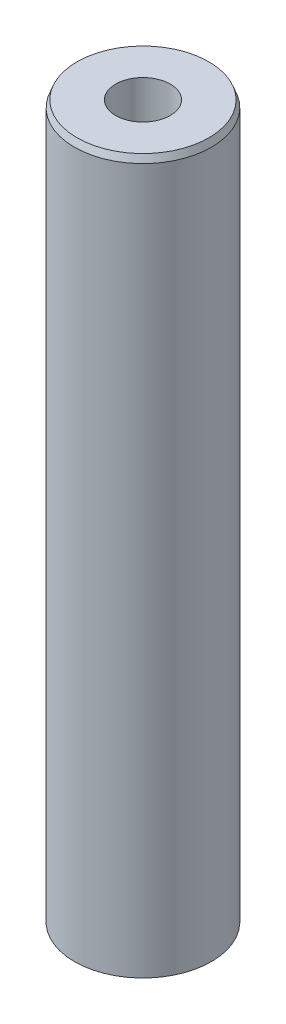
ISO-10303-21;
HEADER;
FILE_DESCRIPTION(('STEP AP214'),'2;1');
FILE_NAME('part.step','',(''),(''),'','','');
FILE_SCHEMA(('AUTOMOTIVE_DESIGN { 1 0 10303 214 1 1 1 1 }'));
ENDSEC;
DATA;
#1=APPLICATION_CONTEXT('core data for automotive mechanical design processes');
#2=APPLICATION_PROTOCOL_DEFINITION('international standard','automotive_design',2000,#1);
#3=PRODUCT_CONTEXT('',#1,'mechanical');
#4=PRODUCT('Part','Part','',(#3));
#5=PRODUCT_RELATED_PRODUCT_CATEGORY('part','',(#4));
#6=PRODUCT_DEFINITION_FORMATION('','',#4);
#7=PRODUCT_DEFINITION_CONTEXT('part definition',#1,'design');
#8=PRODUCT_DEFINITION('design','',#6,#7);
#9=PRODUCT_DEFINITION_SHAPE('','',#8);
#10=(LENGTH_UNIT() NAMED_UNIT(*) SI_UNIT(.MILLI.,.METRE.));
#11=(NAMED_UNIT(*) PLANE_ANGLE_UNIT() SI_UNIT($,.RADIAN.));
#12=(NAMED_UNIT(*) SI_UNIT($,.STERADIAN.) SOLID_ANGLE_UNIT());
#13=UNCERTAINTY_MEASURE_WITH_UNIT(LENGTH_MEASURE(1.E-05),#10,'distance_accuracy_value','');
#14=(GEOMETRIC_REPRESENTATION_CONTEXT(3) GLOBAL_UNCERTAINTY_ASSIGNED_CONTEXT((#13)) GLOBAL_UNIT_ASSIGNED_CONTEXT((#10,
#11,#12)) REPRESENTATION_CONTEXT('',''));
#15=CARTESIAN_POINT('',(0.,0.,0.));
#16=DIRECTION('',(0.,0.,1.));
#17=DIRECTION('',(1.,0.,0.));
#18=AXIS2_PLACEMENT_3D('',#15,#16,#17);
#19=CARTESIAN_POINT('',(0.,600.,0.));
#20=DIRECTION('',(0.,-1.,0.));
#21=DIRECTION('',(0.,0.,-1.));
#22=AXIS2_PLACEMENT_3D('',#19,#20,#21);
#23=CYLINDRICAL_SURFACE('',#22,57.5);
#24=CARTESIAN_POINT('',(0.,594.246226572519,0.));
#25=DIRECTION('',(0.,1.,0.));
#26=DIRECTION('',(0.,0.,1.));
#27=AXIS2_PLACEMENT_3D('',#24,#25,#26);
#28=CIRCLE('',#27,57.5);
#29=CARTESIAN_POINT('',(0.,594.246226572519,57.5));
#30=VERTEX_POINT('',#29);
#31=EDGE_CURVE('E50',#30,#30,#28,.F.);
#32=ORIENTED_EDGE('',*,*,#31,.T.);
#33=EDGE_LOOP('',(#32));
#34=FACE_BOUND('',#33,.T.);
#35=CARTESIAN_POINT('',(0.,2.18927575369654,0.));
#36=DIRECTION('',(0.,1.,0.));
#37=DIRECTION('',(0.,0.,1.));
#38=AXIS2_PLACEMENT_3D('',#35,#36,#37);
#39=CIRCLE('',#38,57.5);
#40=CARTESIAN_POINT('',(0.,2.18927575369654,57.5));
#41=VERTEX_POINT('',#40);
#42=EDGE_CURVE('E51',#41,#41,#39,.T.);
#43=ORIENTED_EDGE('',*,*,#42,.T.);
#44=EDGE_LOOP('',(#43));
#45=FACE_BOUND('',#44,.T.);
#46=ADVANCED_FACE('F39',(#34,#45),#23,.T.);
#47=CARTESIAN_POINT('',(0.,600.,0.));
#48=DIRECTION('',(0.,1.,0.));
#49=DIRECTION('',(0.,0.,1.));
#50=AXIS2_PLACEMENT_3D('',#47,#48,#49);
#51=PLANE('',#50);
#52=CARTESIAN_POINT('',(0.,600.,0.));
#53=DIRECTION('',(0.,1.,0.));
#54=DIRECTION('',(0.,0.,1.));
#55=AXIS2_PLACEMENT_3D('',#52,#53,#54);
#56=CIRCLE('',#55,55.3107242463034);
#57=CARTESIAN_POINT('',(0.,600.,55.3107242463034));
#58=VERTEX_POINT('',#57);
#59=EDGE_CURVE('E54',#58,#58,#56,.T.);
#60=ORIENTED_EDGE('',*,*,#59,.T.);
#61=EDGE_LOOP('',(#60));
#62=FACE_BOUND('',#61,.T.);
#63=CARTESIAN_POINT('',(0.,600.,0.));
#64=DIRECTION('',(0.,1.,0.));
#65=DIRECTION('',(0.,0.,1.));
#66=AXIS2_PLACEMENT_3D('',#63,#64,#65);
#67=CIRCLE('',#66,22.9082333393708);
#68=CARTESIAN_POINT('',(0.,600.,22.9082333393708));
#69=VERTEX_POINT('',#68);
#70=EDGE_CURVE('E58',#69,#69,#67,.T.);
#71=ORIENTED_EDGE('',*,*,#70,.F.);
#72=EDGE_LOOP('',(#71));
#73=FACE_BOUND('',#72,.T.);
#74=ADVANCED_FACE('F69',(#62,#73),#51,.T.);
#75=CARTESIAN_POINT('',(0.,0.,0.));
#76=DIRECTION('',(0.,1.,0.));
#77=DIRECTION('',(0.,0.,1.));
#78=AXIS2_PLACEMENT_3D('',#75,#76,#77);
#79=PLANE('',#78);
#80=CARTESIAN_POINT('',(0.,0.,0.));
#81=DIRECTION('',(0.,1.,0.));
#82=DIRECTION('',(0.,0.,1.));
#83=AXIS2_PLACEMENT_3D('',#80,#81,#82);
#84=CIRCLE('',#83,51.7462265725191);
#85=CARTESIAN_POINT('',(0.,0.,51.7462265725191));
#86=VERTEX_POINT('',#85);
#87=EDGE_CURVE('E10',#86,#86,#84,.F.);
#88=ORIENTED_EDGE('',*,*,#87,.T.);
#89=EDGE_LOOP('',(#88));
#90=FACE_BOUND('',#89,.T.);
#91=CARTESIAN_POINT('',(0.,0.,0.));
#92=DIRECTION('',(0.,1.,0.));
#93=DIRECTION('',(0.,0.,1.));
#94=AXIS2_PLACEMENT_3D('',#91,#92,#93);
#95=CIRCLE('',#94,22.9082333393708);
#96=CARTESIAN_POINT('',(0.,0.,22.9082333393708));
#97=VERTEX_POINT('',#96);
#98=EDGE_CURVE('E63',#97,#97,#95,.T.);
#99=ORIENTED_EDGE('',*,*,#98,.T.);
#100=EDGE_LOOP('',(#99));
#101=FACE_BOUND('',#100,.T.);
#102=ADVANCED_FACE('F75',(#90,#101),#79,.F.);
#103=CARTESIAN_POINT('',(0.,600.,0.));
#104=DIRECTION('',(0.,-1.,0.));
#105=DIRECTION('',(0.,0.,-1.));
#106=AXIS2_PLACEMENT_3D('',#103,#104,#105);
#107=CYLINDRICAL_SURFACE('',#106,22.9082333393708);
#108=ORIENTED_EDGE('',*,*,#70,.T.);
#109=EDGE_LOOP('',(#108));
#110=FACE_BOUND('',#109,.T.);
#111=ORIENTED_EDGE('',*,*,#98,.F.);
#112=EDGE_LOOP('',(#111));
#113=FACE_BOUND('',#112,.T.);
#114=ADVANCED_FACE('F70',(#110,#113),#107,.F.);
#115=CARTESIAN_POINT('',(0.,600.,0.));
#116=DIRECTION('',(0.,-1.,0.));
#117=DIRECTION('',(0.,0.,-1.));
#118=AXIS2_PLACEMENT_3D('',#115,#116,#117);
#119=CONICAL_SURFACE('',#118,55.3107242463034,0.363578528516428);
#120=ORIENTED_EDGE('',*,*,#31,.F.);
#121=EDGE_LOOP('',(#120));
#122=FACE_BOUND('',#121,.T.);
#123=ORIENTED_EDGE('',*,*,#59,.F.);
#124=EDGE_LOOP('',(#123));
#125=FACE_BOUND('',#124,.T.);
#126=ADVANCED_FACE('F81',(#122,#125),#119,.T.);
#127=CARTESIAN_POINT('',(0.,2.18927575369654,0.));
#128=DIRECTION('',(0.,1.,0.));
#129=DIRECTION('',(0.,0.,1.));
#130=AXIS2_PLACEMENT_3D('',#127,#128,#129);
#131=CONICAL_SURFACE('',#130,57.5,1.20721779827846);
#132=ORIENTED_EDGE('',*,*,#87,.F.);
#133=EDGE_LOOP('',(#132));
#134=FACE_BOUND('',#133,.T.);
#135=ORIENTED_EDGE('',*,*,#42,.F.);
#136=EDGE_LOOP('',(#135));
#137=FACE_BOUND('',#136,.T.);
#138=ADVANCED_FACE('F45',(#134,#137),#131,.T.);
#139=CLOSED_SHELL('',(#46,#74,#102,#114,#126,#138));
#140=MANIFOLD_SOLID_BREP('B2',#139);
#141=ADVANCED_BREP_SHAPE_REPRESENTATION('',(#18,#140),#14);
#142=SHAPE_DEFINITION_REPRESENTATION(#9,#141);
ENDSEC;
END-ISO-10303-21;
